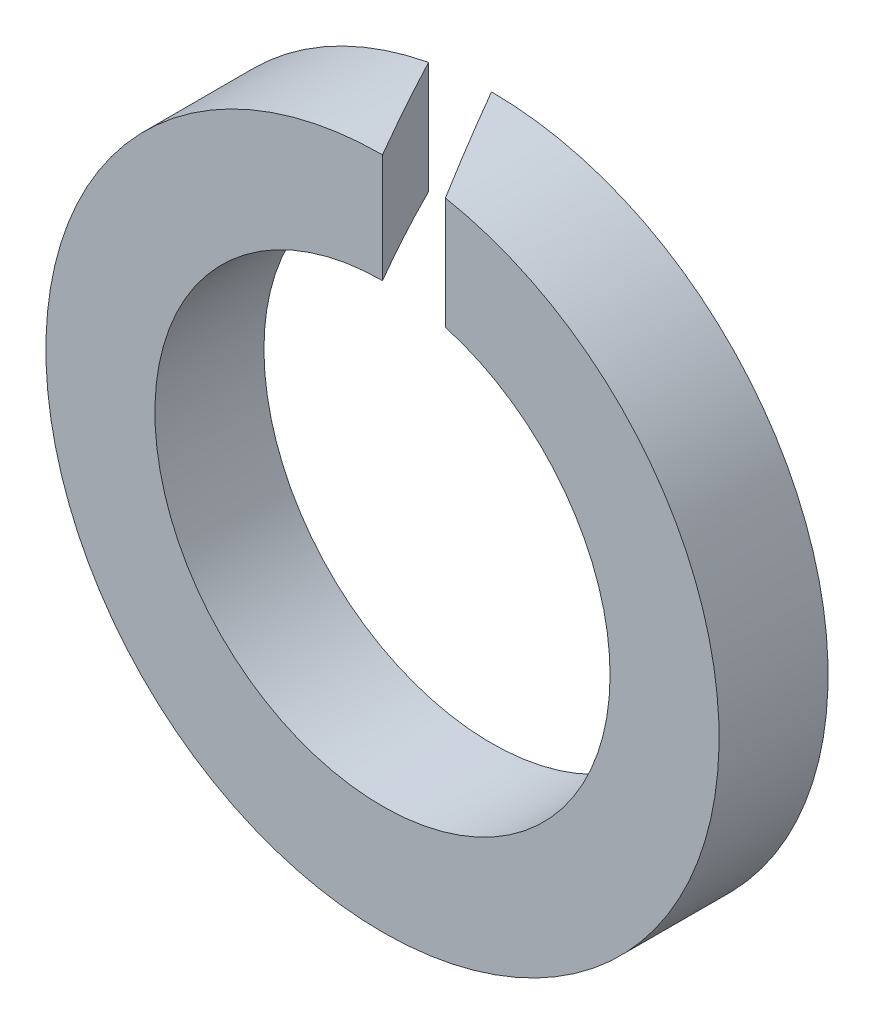
ISO-10303-21;
HEADER;
FILE_DESCRIPTION(('STEP AP214'),'2;1');
FILE_NAME('part.step','',(''),(''),'','','');
FILE_SCHEMA(('AUTOMOTIVE_DESIGN { 1 0 10303 214 1 1 1 1 }'));
ENDSEC;
DATA;
#1=APPLICATION_CONTEXT('core data for automotive mechanical design processes');
#2=APPLICATION_PROTOCOL_DEFINITION('international standard','automotive_design',2000,#1);
#3=PRODUCT_CONTEXT('',#1,'mechanical');
#4=PRODUCT('Part','Part','',(#3));
#5=PRODUCT_RELATED_PRODUCT_CATEGORY('part','',(#4));
#6=PRODUCT_DEFINITION_FORMATION('','',#4);
#7=PRODUCT_DEFINITION_CONTEXT('part definition',#1,'design');
#8=PRODUCT_DEFINITION('design','',#6,#7);
#9=PRODUCT_DEFINITION_SHAPE('','',#8);
#10=(LENGTH_UNIT() NAMED_UNIT(*) SI_UNIT(.MILLI.,.METRE.));
#11=(NAMED_UNIT(*) PLANE_ANGLE_UNIT() SI_UNIT($,.RADIAN.));
#12=(NAMED_UNIT(*) SI_UNIT($,.STERADIAN.) SOLID_ANGLE_UNIT());
#13=UNCERTAINTY_MEASURE_WITH_UNIT(LENGTH_MEASURE(1.E-05),#10,'distance_accuracy_value','');
#14=(GEOMETRIC_REPRESENTATION_CONTEXT(3) GLOBAL_UNCERTAINTY_ASSIGNED_CONTEXT((#13)) GLOBAL_UNIT_ASSIGNED_CONTEXT((#10,
#11,#12)) REPRESENTATION_CONTEXT('',''));
#15=CARTESIAN_POINT('',(0.,0.,0.));
#16=DIRECTION('',(0.,0.,1.));
#17=DIRECTION('',(1.,0.,0.));
#18=AXIS2_PLACEMENT_3D('',#15,#16,#17);
#19=CARTESIAN_POINT('',(0.,0.,-1.6));
#20=DIRECTION('',(0.,0.,1.));
#21=DIRECTION('',(1.,0.,0.));
#22=AXIS2_PLACEMENT_3D('',#19,#20,#21);
#23=CYLINDRICAL_SURFACE('',#22,4.94);
#24=CARTESIAN_POINT('',(0.,0.,0.));
#25=DIRECTION('',(0.,0.,1.));
#26=DIRECTION('',(1.,0.,0.));
#27=AXIS2_PLACEMENT_3D('',#24,#25,#26);
#28=CIRCLE('',#27,4.94);
#29=CARTESIAN_POINT('',(0.,4.94,0.));
#30=VERTEX_POINT('',#29);
#31=CARTESIAN_POINT('',(0.923760430703401,4.85286169869559,0.));
#32=VERTEX_POINT('',#31);
#33=EDGE_CURVE('E86',#30,#32,#28,.T.);
#34=ORIENTED_EDGE('',*,*,#33,.F.);
#35=CARTESIAN_POINT('',(0.,0.,0.));
#36=DIRECTION('',(0.866025403784439,0.,-0.5));
#37=DIRECTION('',(0.5,0.,0.866025403784439));
#38=AXIS2_PLACEMENT_3D('',#35,#36,#37);
#39=ELLIPSE('',#38,9.88,4.94);
#40=CARTESIAN_POINT('',(-0.923760430703401,4.85286169869559,-1.6));
#41=VERTEX_POINT('',#40);
#42=EDGE_CURVE('E70',#30,#41,#39,.F.);
#43=ORIENTED_EDGE('',*,*,#42,.T.);
#44=CARTESIAN_POINT('',(0.,0.,-1.6));
#45=DIRECTION('',(0.,0.,1.));
#46=DIRECTION('',(1.,0.,0.));
#47=AXIS2_PLACEMENT_3D('',#44,#45,#46);
#48=CIRCLE('',#47,4.94);
#49=CARTESIAN_POINT('',(0.,4.94,-1.6));
#50=VERTEX_POINT('',#49);
#51=EDGE_CURVE('E91',#41,#50,#48,.T.);
#52=ORIENTED_EDGE('',*,*,#51,.T.);
#53=CARTESIAN_POINT('',(0.,0.,-1.6));
#54=DIRECTION('',(-0.866025403784439,0.,0.5));
#55=DIRECTION('',(0.5,0.,0.866025403784439));
#56=AXIS2_PLACEMENT_3D('',#53,#54,#55);
#57=ELLIPSE('',#56,9.88,4.94);
#58=EDGE_CURVE('E79',#50,#32,#57,.F.);
#59=ORIENTED_EDGE('',*,*,#58,.T.);
#60=EDGE_LOOP('',(#34,#43,#52,#59));
#61=FACE_BOUND('',#60,.T.);
#62=ADVANCED_FACE('F33',(#61),#23,.T.);
#63=CARTESIAN_POINT('',(0.,0.,-1.6));
#64=DIRECTION('',(0.,0.,1.));
#65=DIRECTION('',(1.,0.,0.));
#66=AXIS2_PLACEMENT_3D('',#63,#64,#65);
#67=PLANE('',#66);
#68=DIRECTION('',(0.,-1.,0.));
#69=VECTOR('',#68,1.);
#70=CARTESIAN_POINT('',(-0.923760430703401,4.94,-1.6));
#71=LINE('',#70,#69);
#72=CARTESIAN_POINT('',(-0.923760430703401,3.20971442135693,-1.6));
#73=VERTEX_POINT('',#72);
#74=EDGE_CURVE('E73',#41,#73,#71,.T.);
#75=ORIENTED_EDGE('',*,*,#74,.T.);
#76=CARTESIAN_POINT('',(0.,0.,-1.6));
#77=DIRECTION('',(0.,0.,1.));
#78=DIRECTION('',(1.,0.,0.));
#79=AXIS2_PLACEMENT_3D('',#76,#77,#78);
#80=CIRCLE('',#79,3.34);
#81=CARTESIAN_POINT('',(0.,3.34,-1.6));
#82=VERTEX_POINT('',#81);
#83=EDGE_CURVE('E92',#73,#82,#80,.T.);
#84=ORIENTED_EDGE('',*,*,#83,.T.);
#85=DIRECTION('',(0.,-1.,0.));
#86=VECTOR('',#85,1.);
#87=CARTESIAN_POINT('',(0.,4.94,-1.6));
#88=LINE('',#87,#86);
#89=EDGE_CURVE('E54',#50,#82,#88,.T.);
#90=ORIENTED_EDGE('',*,*,#89,.F.);
#91=ORIENTED_EDGE('',*,*,#51,.F.);
#92=EDGE_LOOP('',(#75,#84,#90,#91));
#93=FACE_BOUND('',#92,.T.);
#94=ADVANCED_FACE('F107',(#93),#67,.F.);
#95=CARTESIAN_POINT('',(0.,0.,0.));
#96=DIRECTION('',(0.,0.,1.));
#97=DIRECTION('',(1.,0.,0.));
#98=AXIS2_PLACEMENT_3D('',#95,#96,#97);
#99=PLANE('',#98);
#100=CARTESIAN_POINT('',(0.,0.,0.));
#101=DIRECTION('',(0.,0.,1.));
#102=DIRECTION('',(1.,0.,0.));
#103=AXIS2_PLACEMENT_3D('',#100,#101,#102);
#104=CIRCLE('',#103,3.34);
#105=CARTESIAN_POINT('',(0.,3.34,0.));
#106=VERTEX_POINT('',#105);
#107=CARTESIAN_POINT('',(0.923760430703401,3.20971442135693,0.));
#108=VERTEX_POINT('',#107);
#109=EDGE_CURVE('E78',#106,#108,#104,.T.);
#110=ORIENTED_EDGE('',*,*,#109,.F.);
#111=DIRECTION('',(0.,-1.,0.));
#112=VECTOR('',#111,1.);
#113=CARTESIAN_POINT('',(0.,4.94,0.));
#114=LINE('',#113,#112);
#115=EDGE_CURVE('E46',#30,#106,#114,.T.);
#116=ORIENTED_EDGE('',*,*,#115,.F.);
#117=ORIENTED_EDGE('',*,*,#33,.T.);
#118=DIRECTION('',(0.,-1.,0.));
#119=VECTOR('',#118,1.);
#120=CARTESIAN_POINT('',(0.923760430703401,4.94,0.));
#121=LINE('',#120,#119);
#122=EDGE_CURVE('E88',#32,#108,#121,.T.);
#123=ORIENTED_EDGE('',*,*,#122,.T.);
#124=EDGE_LOOP('',(#110,#116,#117,#123));
#125=FACE_BOUND('',#124,.T.);
#126=ADVANCED_FACE('F84',(#125),#99,.T.);
#127=CARTESIAN_POINT('',(0.,0.,-1.6));
#128=DIRECTION('',(0.,0.,1.));
#129=DIRECTION('',(1.,0.,0.));
#130=AXIS2_PLACEMENT_3D('',#127,#128,#129);
#131=CYLINDRICAL_SURFACE('',#130,3.34);
#132=CARTESIAN_POINT('',(0.,0.,0.));
#133=DIRECTION('',(0.866025403784439,0.,-0.5));
#134=DIRECTION('',(0.5,0.,0.866025403784439));
#135=AXIS2_PLACEMENT_3D('',#132,#133,#134);
#136=ELLIPSE('',#135,6.68,3.34);
#137=EDGE_CURVE('E11',#106,#73,#136,.F.);
#138=ORIENTED_EDGE('',*,*,#137,.F.);
#139=ORIENTED_EDGE('',*,*,#109,.T.);
#140=CARTESIAN_POINT('',(0.,0.,-1.6));
#141=DIRECTION('',(-0.866025403784439,0.,0.5));
#142=DIRECTION('',(0.5,0.,0.866025403784439));
#143=AXIS2_PLACEMENT_3D('',#140,#141,#142);
#144=ELLIPSE('',#143,6.68,3.34);
#145=EDGE_CURVE('E40',#82,#108,#144,.F.);
#146=ORIENTED_EDGE('',*,*,#145,.F.);
#147=ORIENTED_EDGE('',*,*,#83,.F.);
#148=EDGE_LOOP('',(#138,#139,#146,#147));
#149=FACE_BOUND('',#148,.T.);
#150=ADVANCED_FACE('F102',(#149),#131,.F.);
#151=CARTESIAN_POINT('',(0.,4.94,-1.6));
#152=DIRECTION('',(-0.866025403784439,0.,0.5));
#153=DIRECTION('',(0.5,0.,0.866025403784439));
#154=AXIS2_PLACEMENT_3D('',#151,#152,#153);
#155=PLANE('',#154);
#156=ORIENTED_EDGE('',*,*,#89,.T.);
#157=ORIENTED_EDGE('',*,*,#145,.T.);
#158=ORIENTED_EDGE('',*,*,#122,.F.);
#159=ORIENTED_EDGE('',*,*,#58,.F.);
#160=EDGE_LOOP('',(#156,#157,#158,#159));
#161=FACE_BOUND('',#160,.T.);
#162=ADVANCED_FACE('F98',(#161),#155,.T.);
#163=CARTESIAN_POINT('',(0.,4.94,0.));
#164=DIRECTION('',(0.866025403784439,0.,-0.5));
#165=DIRECTION('',(-0.5,0.,-0.866025403784439));
#166=AXIS2_PLACEMENT_3D('',#163,#164,#165);
#167=PLANE('',#166);
#168=ORIENTED_EDGE('',*,*,#115,.T.);
#169=ORIENTED_EDGE('',*,*,#137,.T.);
#170=ORIENTED_EDGE('',*,*,#74,.F.);
#171=ORIENTED_EDGE('',*,*,#42,.F.);
#172=EDGE_LOOP('',(#168,#169,#170,#171));
#173=FACE_BOUND('',#172,.T.);
#174=ADVANCED_FACE('F71',(#173),#167,.T.);
#175=CLOSED_SHELL('',(#62,#94,#126,#150,#162,#174));
#176=MANIFOLD_SOLID_BREP('B2',#175);
#177=ADVANCED_BREP_SHAPE_REPRESENTATION('',(#18,#176),#14);
#178=SHAPE_DEFINITION_REPRESENTATION(#9,#177);
ENDSEC;
END-ISO-10303-21;
